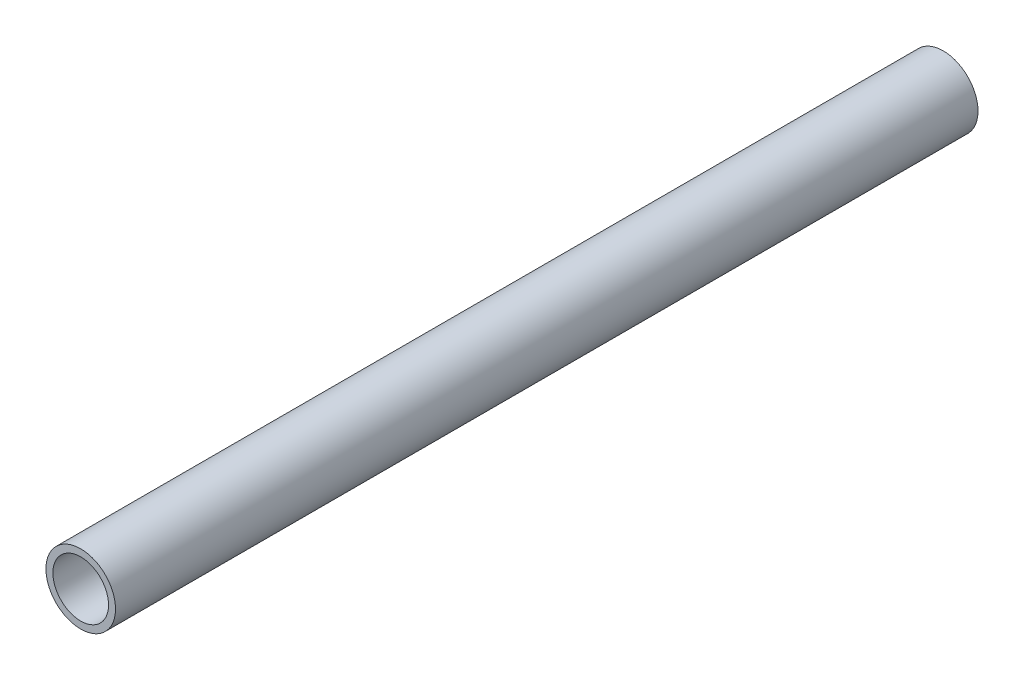
ISO-10303-21;
HEADER;
FILE_DESCRIPTION(('STEP AP214'),'2;1');
FILE_NAME('part.step','',(''),(''),'','','');
FILE_SCHEMA(('AUTOMOTIVE_DESIGN { 1 0 10303 214 1 1 1 1 }'));
ENDSEC;
DATA;
#1=APPLICATION_CONTEXT('core data for automotive mechanical design processes');
#2=APPLICATION_PROTOCOL_DEFINITION('international standard','automotive_design',2000,#1);
#3=PRODUCT_CONTEXT('',#1,'mechanical');
#4=PRODUCT('Part','Part','',(#3));
#5=PRODUCT_RELATED_PRODUCT_CATEGORY('part','',(#4));
#6=PRODUCT_DEFINITION_FORMATION('','',#4);
#7=PRODUCT_DEFINITION_CONTEXT('part definition',#1,'design');
#8=PRODUCT_DEFINITION('design','',#6,#7);
#9=PRODUCT_DEFINITION_SHAPE('','',#8);
#10=(LENGTH_UNIT() NAMED_UNIT(*) SI_UNIT(.MILLI.,.METRE.));
#11=(NAMED_UNIT(*) PLANE_ANGLE_UNIT() SI_UNIT($,.RADIAN.));
#12=(NAMED_UNIT(*) SI_UNIT($,.STERADIAN.) SOLID_ANGLE_UNIT());
#13=UNCERTAINTY_MEASURE_WITH_UNIT(LENGTH_MEASURE(1.E-05),#10,'distance_accuracy_value','');
#14=(GEOMETRIC_REPRESENTATION_CONTEXT(3) GLOBAL_UNCERTAINTY_ASSIGNED_CONTEXT((#13)) GLOBAL_UNIT_ASSIGNED_CONTEXT((#10,
#11,#12)) REPRESENTATION_CONTEXT('',''));
#15=CARTESIAN_POINT('',(0.,0.,0.));
#16=DIRECTION('',(0.,0.,1.));
#17=DIRECTION('',(1.,0.,0.));
#18=AXIS2_PLACEMENT_3D('',#15,#16,#17);
#19=CARTESIAN_POINT('',(0.,0.,31.));
#20=DIRECTION('',(0.,0.,1.));
#21=DIRECTION('',(1.,0.,0.));
#22=AXIS2_PLACEMENT_3D('',#19,#20,#21);
#23=PLANE('',#22);
#24=CARTESIAN_POINT('',(0.,0.,31.));
#25=DIRECTION('',(0.,0.,1.));
#26=DIRECTION('',(1.,0.,0.));
#27=AXIS2_PLACEMENT_3D('',#24,#25,#26);
#28=CIRCLE('',#27,1.25);
#29=CARTESIAN_POINT('',(1.25,0.,31.));
#30=VERTEX_POINT('',#29);
#31=EDGE_CURVE('E10',#30,#30,#28,.T.);
#32=ORIENTED_EDGE('',*,*,#31,.T.);
#33=EDGE_LOOP('',(#32));
#34=FACE_BOUND('',#33,.T.);
#35=CARTESIAN_POINT('',(0.,0.,31.));
#36=DIRECTION('',(0.,0.,1.));
#37=DIRECTION('',(1.,0.,0.));
#38=AXIS2_PLACEMENT_3D('',#35,#36,#37);
#39=CIRCLE('',#38,1.);
#40=CARTESIAN_POINT('',(1.,0.,31.));
#41=VERTEX_POINT('',#40);
#42=EDGE_CURVE('E42',#41,#41,#39,.T.);
#43=ORIENTED_EDGE('',*,*,#42,.F.);
#44=EDGE_LOOP('',(#43));
#45=FACE_BOUND('',#44,.T.);
#46=ADVANCED_FACE('F31',(#34,#45),#23,.T.);
#47=CARTESIAN_POINT('',(0.,0.,0.));
#48=DIRECTION('',(0.,0.,1.));
#49=DIRECTION('',(1.,0.,0.));
#50=AXIS2_PLACEMENT_3D('',#47,#48,#49);
#51=PLANE('',#50);
#52=CARTESIAN_POINT('',(0.,0.,0.));
#53=DIRECTION('',(0.,0.,1.));
#54=DIRECTION('',(1.,0.,0.));
#55=AXIS2_PLACEMENT_3D('',#52,#53,#54);
#56=CIRCLE('',#55,1.25);
#57=CARTESIAN_POINT('',(1.25,0.,0.));
#58=VERTEX_POINT('',#57);
#59=EDGE_CURVE('E35',#58,#58,#56,.T.);
#60=ORIENTED_EDGE('',*,*,#59,.F.);
#61=EDGE_LOOP('',(#60));
#62=FACE_BOUND('',#61,.T.);
#63=CARTESIAN_POINT('',(0.,0.,0.));
#64=DIRECTION('',(0.,0.,1.));
#65=DIRECTION('',(1.,0.,0.));
#66=AXIS2_PLACEMENT_3D('',#63,#64,#65);
#67=CIRCLE('',#66,1.);
#68=CARTESIAN_POINT('',(1.,0.,0.));
#69=VERTEX_POINT('',#68);
#70=EDGE_CURVE('E44',#69,#69,#67,.T.);
#71=ORIENTED_EDGE('',*,*,#70,.T.);
#72=EDGE_LOOP('',(#71));
#73=FACE_BOUND('',#72,.T.);
#74=ADVANCED_FACE('F54',(#62,#73),#51,.F.);
#75=CARTESIAN_POINT('',(0.,0.,31.));
#76=DIRECTION('',(0.,0.,-1.));
#77=DIRECTION('',(-1.,0.,0.));
#78=AXIS2_PLACEMENT_3D('',#75,#76,#77);
#79=CYLINDRICAL_SURFACE('',#78,1.25);
#80=ORIENTED_EDGE('',*,*,#31,.F.);
#81=EDGE_LOOP('',(#80));
#82=FACE_BOUND('',#81,.T.);
#83=ORIENTED_EDGE('',*,*,#59,.T.);
#84=EDGE_LOOP('',(#83));
#85=FACE_BOUND('',#84,.T.);
#86=ADVANCED_FACE('F33',(#82,#85),#79,.T.);
#87=CARTESIAN_POINT('',(0.,0.,31.));
#88=DIRECTION('',(0.,0.,-1.));
#89=DIRECTION('',(-1.,0.,0.));
#90=AXIS2_PLACEMENT_3D('',#87,#88,#89);
#91=CYLINDRICAL_SURFACE('',#90,1.);
#92=ORIENTED_EDGE('',*,*,#42,.T.);
#93=EDGE_LOOP('',(#92));
#94=FACE_BOUND('',#93,.T.);
#95=ORIENTED_EDGE('',*,*,#70,.F.);
#96=EDGE_LOOP('',(#95));
#97=FACE_BOUND('',#96,.T.);
#98=ADVANCED_FACE('F50',(#94,#97),#91,.F.);
#99=CLOSED_SHELL('',(#46,#74,#86,#98));
#100=MANIFOLD_SOLID_BREP('B2',#99);
#101=ADVANCED_BREP_SHAPE_REPRESENTATION('',(#18,#100),#14);
#102=SHAPE_DEFINITION_REPRESENTATION(#9,#101);
ENDSEC;
END-ISO-10303-21;
